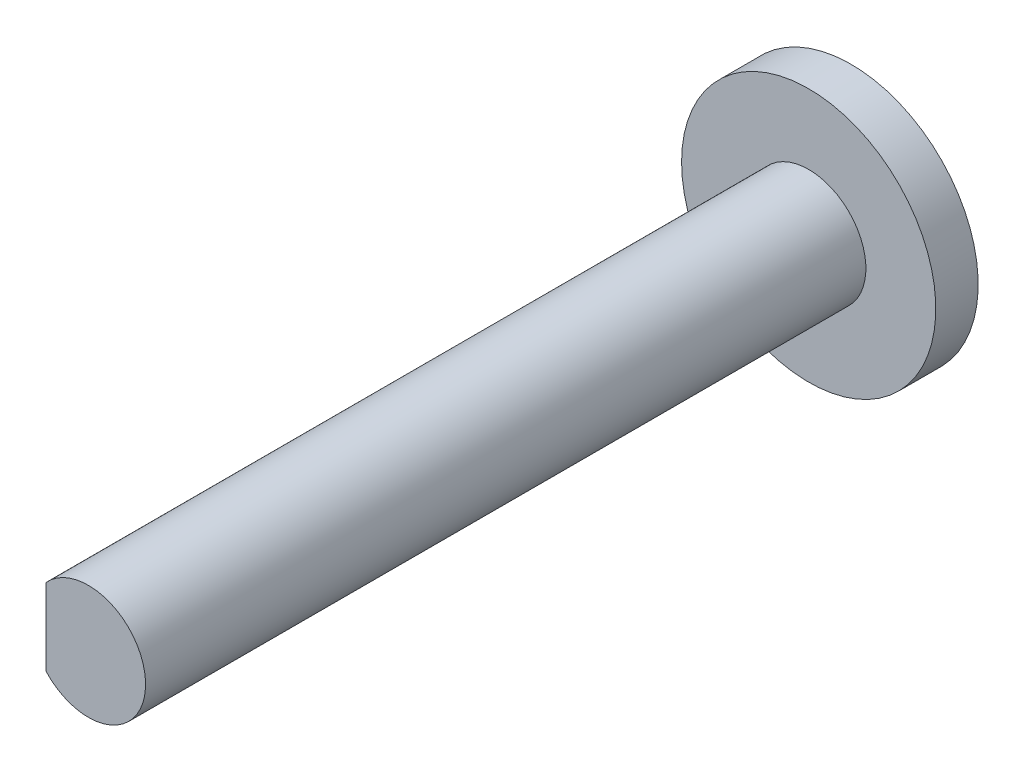
ISO-10303-21;
HEADER;
FILE_DESCRIPTION(('STEP AP214'),'2;1');
FILE_NAME('part.step','',(''),(''),'','','');
FILE_SCHEMA(('AUTOMOTIVE_DESIGN { 1 0 10303 214 1 1 1 1 }'));
ENDSEC;
DATA;
#1=APPLICATION_CONTEXT('core data for automotive mechanical design processes');
#2=APPLICATION_PROTOCOL_DEFINITION('international standard','automotive_design',2000,#1);
#3=PRODUCT_CONTEXT('',#1,'mechanical');
#4=PRODUCT('Part','Part','',(#3));
#5=PRODUCT_RELATED_PRODUCT_CATEGORY('part','',(#4));
#6=PRODUCT_DEFINITION_FORMATION('','',#4);
#7=PRODUCT_DEFINITION_CONTEXT('part definition',#1,'design');
#8=PRODUCT_DEFINITION('design','',#6,#7);
#9=PRODUCT_DEFINITION_SHAPE('','',#8);
#10=(LENGTH_UNIT() NAMED_UNIT(*) SI_UNIT(.MILLI.,.METRE.));
#11=(NAMED_UNIT(*) PLANE_ANGLE_UNIT() SI_UNIT($,.RADIAN.));
#12=(NAMED_UNIT(*) SI_UNIT($,.STERADIAN.) SOLID_ANGLE_UNIT());
#13=UNCERTAINTY_MEASURE_WITH_UNIT(LENGTH_MEASURE(1.E-05),#10,'distance_accuracy_value','');
#14=(GEOMETRIC_REPRESENTATION_CONTEXT(3) GLOBAL_UNCERTAINTY_ASSIGNED_CONTEXT((#13)) GLOBAL_UNIT_ASSIGNED_CONTEXT((#10,
#11,#12)) REPRESENTATION_CONTEXT('',''));
#15=CARTESIAN_POINT('',(0.,0.,0.));
#16=DIRECTION('',(0.,0.,1.));
#17=DIRECTION('',(1.,0.,0.));
#18=AXIS2_PLACEMENT_3D('',#15,#16,#17);
#19=CARTESIAN_POINT('',(0.,0.,8.5));
#20=DIRECTION('',(0.,0.,-1.));
#21=DIRECTION('',(-1.,0.,0.));
#22=AXIS2_PLACEMENT_3D('',#19,#20,#21);
#23=CYLINDRICAL_SURFACE('',#22,1.35);
#24=CARTESIAN_POINT('',(0.,0.,8.5));
#25=DIRECTION('',(0.,0.,1.));
#26=DIRECTION('',(1.,0.,0.));
#27=AXIS2_PLACEMENT_3D('',#24,#25,#26);
#28=CIRCLE('',#27,1.35);
#29=CARTESIAN_POINT('',(-1.,-0.906917857360853,8.5));
#30=VERTEX_POINT('',#29);
#31=CARTESIAN_POINT('',(-1.,0.906917857360853,8.5));
#32=VERTEX_POINT('',#31);
#33=EDGE_CURVE('E11',#30,#32,#28,.T.);
#34=ORIENTED_EDGE('',*,*,#33,.F.);
#35=DIRECTION('',(0.,0.,1.));
#36=VECTOR('',#35,1.);
#37=CARTESIAN_POINT('',(-1.,-0.906917857360853,5.3));
#38=LINE('',#37,#36);
#39=CARTESIAN_POINT('',(-1.,-0.906917857360853,5.3));
#40=VERTEX_POINT('',#39);
#41=EDGE_CURVE('E54',#40,#30,#38,.T.);
#42=ORIENTED_EDGE('',*,*,#41,.F.);
#43=CARTESIAN_POINT('',(0.,0.,5.3));
#44=DIRECTION('',(0.,0.,1.));
#45=DIRECTION('',(1.,0.,0.));
#46=AXIS2_PLACEMENT_3D('',#43,#44,#45);
#47=CIRCLE('',#46,1.35);
#48=CARTESIAN_POINT('',(-1.,0.906917857360853,5.3));
#49=VERTEX_POINT('',#48);
#50=EDGE_CURVE('E116',#49,#40,#47,.T.);
#51=ORIENTED_EDGE('',*,*,#50,.F.);
#52=DIRECTION('',(0.,0.,1.));
#53=VECTOR('',#52,1.);
#54=CARTESIAN_POINT('',(-1.,0.906917857360853,5.3));
#55=LINE('',#54,#53);
#56=EDGE_CURVE('E78',#49,#32,#55,.T.);
#57=ORIENTED_EDGE('',*,*,#56,.T.);
#58=EDGE_LOOP('',(#34,#42,#51,#57));
#59=FACE_BOUND('',#58,.T.);
#60=CARTESIAN_POINT('',(0.,0.,-2.1));
#61=DIRECTION('',(0.,0.,-1.));
#62=DIRECTION('',(-1.,0.,0.));
#63=AXIS2_PLACEMENT_3D('',#60,#61,#62);
#64=CIRCLE('',#63,1.35);
#65=CARTESIAN_POINT('',(-1.,-0.906917857360853,-2.1));
#66=VERTEX_POINT('',#65);
#67=CARTESIAN_POINT('',(-1.,0.906917857360853,-2.1));
#68=VERTEX_POINT('',#67);
#69=EDGE_CURVE('E91',#66,#68,#64,.T.);
#70=ORIENTED_EDGE('',*,*,#69,.F.);
#71=DIRECTION('',(0.,0.,-1.));
#72=VECTOR('',#71,1.);
#73=CARTESIAN_POINT('',(-1.,-0.906917857360853,-2.1));
#74=LINE('',#73,#72);
#75=CARTESIAN_POINT('',(-1.,-0.906917857360853,-8.5));
#76=VERTEX_POINT('',#75);
#77=EDGE_CURVE('E63',#66,#76,#74,.T.);
#78=ORIENTED_EDGE('',*,*,#77,.T.);
#79=CARTESIAN_POINT('',(0.,0.,-8.5));
#80=DIRECTION('',(0.,0.,1.));
#81=DIRECTION('',(1.,0.,0.));
#82=AXIS2_PLACEMENT_3D('',#79,#80,#81);
#83=CIRCLE('',#82,1.35);
#84=CARTESIAN_POINT('',(-1.,0.906917857360853,-8.5));
#85=VERTEX_POINT('',#84);
#86=EDGE_CURVE('E42',#76,#85,#83,.T.);
#87=ORIENTED_EDGE('',*,*,#86,.T.);
#88=DIRECTION('',(0.,0.,-1.));
#89=VECTOR('',#88,1.);
#90=CARTESIAN_POINT('',(-1.,0.906917857360853,-2.1));
#91=LINE('',#90,#89);
#92=EDGE_CURVE('E94',#68,#85,#91,.T.);
#93=ORIENTED_EDGE('',*,*,#92,.F.);
#94=EDGE_LOOP('',(#70,#78,#87,#93));
#95=FACE_BOUND('',#94,.T.);
#96=ADVANCED_FACE('F39',(#59,#95),#23,.T.);
#97=CARTESIAN_POINT('',(0.,0.,8.5));
#98=DIRECTION('',(0.,0.,1.));
#99=DIRECTION('',(1.,0.,0.));
#100=AXIS2_PLACEMENT_3D('',#97,#98,#99);
#101=PLANE('',#100);
#102=DIRECTION('',(0.,1.,0.));
#103=VECTOR('',#102,1.);
#104=CARTESIAN_POINT('',(-1.,0.906917857360853,8.5));
#105=LINE('',#104,#103);
#106=EDGE_CURVE('E85',#30,#32,#105,.T.);
#107=ORIENTED_EDGE('',*,*,#106,.F.);
#108=ORIENTED_EDGE('',*,*,#33,.T.);
#109=EDGE_LOOP('',(#107,#108));
#110=FACE_BOUND('',#109,.T.);
#111=ADVANCED_FACE('F145',(#110),#101,.T.);
#112=CARTESIAN_POINT('',(-1.,0.906917857360853,-2.1));
#113=DIRECTION('',(1.,0.,0.));
#114=DIRECTION('',(0.,0.,-1.));
#115=AXIS2_PLACEMENT_3D('',#112,#113,#114);
#116=PLANE('',#115);
#117=DIRECTION('',(0.,-1.,0.));
#118=VECTOR('',#117,1.);
#119=CARTESIAN_POINT('',(-1.,0.906917857360853,-8.5));
#120=LINE('',#119,#118);
#121=EDGE_CURVE('E86',#85,#76,#120,.T.);
#122=ORIENTED_EDGE('',*,*,#121,.T.);
#123=ORIENTED_EDGE('',*,*,#77,.F.);
#124=DIRECTION('',(0.,-1.,0.));
#125=VECTOR('',#124,1.);
#126=CARTESIAN_POINT('',(-1.,0.906917857360853,-2.1));
#127=LINE('',#126,#125);
#128=EDGE_CURVE('E96',#68,#66,#127,.T.);
#129=ORIENTED_EDGE('',*,*,#128,.F.);
#130=ORIENTED_EDGE('',*,*,#92,.T.);
#131=EDGE_LOOP('',(#122,#123,#129,#130));
#132=FACE_BOUND('',#131,.T.);
#133=ADVANCED_FACE('F95',(#132),#116,.F.);
#134=CARTESIAN_POINT('',(0.,0.,-2.1));
#135=DIRECTION('',(0.,0.,-1.));
#136=DIRECTION('',(-1.,0.,0.));
#137=AXIS2_PLACEMENT_3D('',#134,#135,#136);
#138=PLANE('',#137);
#139=ORIENTED_EDGE('',*,*,#69,.T.);
#140=ORIENTED_EDGE('',*,*,#128,.T.);
#141=EDGE_LOOP('',(#139,#140));
#142=FACE_BOUND('',#141,.T.);
#143=ADVANCED_FACE('F158',(#142),#138,.T.);
#144=CARTESIAN_POINT('',(-1.,0.906917857360853,5.3));
#145=DIRECTION('',(1.,0.,0.));
#146=DIRECTION('',(0.,0.,-1.));
#147=AXIS2_PLACEMENT_3D('',#144,#145,#146);
#148=PLANE('',#147);
#149=ORIENTED_EDGE('',*,*,#106,.T.);
#150=ORIENTED_EDGE('',*,*,#56,.F.);
#151=DIRECTION('',(0.,1.,0.));
#152=VECTOR('',#151,1.);
#153=CARTESIAN_POINT('',(-1.,0.906917857360853,5.3));
#154=LINE('',#153,#152);
#155=EDGE_CURVE('E111',#40,#49,#154,.T.);
#156=ORIENTED_EDGE('',*,*,#155,.F.);
#157=ORIENTED_EDGE('',*,*,#41,.T.);
#158=EDGE_LOOP('',(#149,#150,#156,#157));
#159=FACE_BOUND('',#158,.T.);
#160=ADVANCED_FACE('F156',(#159),#148,.F.);
#161=CARTESIAN_POINT('',(0.,0.,5.3));
#162=DIRECTION('',(0.,0.,1.));
#163=DIRECTION('',(1.,0.,0.));
#164=AXIS2_PLACEMENT_3D('',#161,#162,#163);
#165=PLANE('',#164);
#166=ORIENTED_EDGE('',*,*,#50,.T.);
#167=ORIENTED_EDGE('',*,*,#155,.T.);
#168=EDGE_LOOP('',(#166,#167));
#169=FACE_BOUND('',#168,.T.);
#170=ADVANCED_FACE('F135',(#169),#165,.T.);
#171=CARTESIAN_POINT('',(0.,0.,-9.5));
#172=DIRECTION('',(0.,0.,1.));
#173=DIRECTION('',(1.,0.,0.));
#174=AXIS2_PLACEMENT_3D('',#171,#172,#173);
#175=CYLINDRICAL_SURFACE('',#174,3.);
#176=CARTESIAN_POINT('',(0.,0.,-9.5));
#177=DIRECTION('',(0.,0.,-1.));
#178=DIRECTION('',(-1.,0.,0.));
#179=AXIS2_PLACEMENT_3D('',#176,#177,#178);
#180=CIRCLE('',#179,3.);
#181=CARTESIAN_POINT('',(-3.,0.,-9.5));
#182=VERTEX_POINT('',#181);
#183=EDGE_CURVE('E117',#182,#182,#180,.T.);
#184=ORIENTED_EDGE('',*,*,#183,.F.);
#185=EDGE_LOOP('',(#184));
#186=FACE_BOUND('',#185,.T.);
#187=CARTESIAN_POINT('',(0.,0.,-8.5));
#188=DIRECTION('',(0.,0.,-1.));
#189=DIRECTION('',(-1.,0.,0.));
#190=AXIS2_PLACEMENT_3D('',#187,#188,#189);
#191=CIRCLE('',#190,3.);
#192=CARTESIAN_POINT('',(-3.,0.,-8.5));
#193=VERTEX_POINT('',#192);
#194=EDGE_CURVE('E122',#193,#193,#191,.T.);
#195=ORIENTED_EDGE('',*,*,#194,.T.);
#196=EDGE_LOOP('',(#195));
#197=FACE_BOUND('',#196,.T.);
#198=ADVANCED_FACE('F132',(#186,#197),#175,.T.);
#199=CARTESIAN_POINT('',(0.,0.,-9.5));
#200=DIRECTION('',(0.,0.,-1.));
#201=DIRECTION('',(-1.,0.,0.));
#202=AXIS2_PLACEMENT_3D('',#199,#200,#201);
#203=PLANE('',#202);
#204=ORIENTED_EDGE('',*,*,#183,.T.);
#205=EDGE_LOOP('',(#204));
#206=FACE_BOUND('',#205,.T.);
#207=ADVANCED_FACE('F130',(#206),#203,.T.);
#208=CARTESIAN_POINT('',(0.,0.,-8.5));
#209=DIRECTION('',(0.,0.,-1.));
#210=DIRECTION('',(-1.,0.,0.));
#211=AXIS2_PLACEMENT_3D('',#208,#209,#210);
#212=PLANE('',#211);
#213=ORIENTED_EDGE('',*,*,#86,.F.);
#214=ORIENTED_EDGE('',*,*,#121,.F.);
#215=EDGE_LOOP('',(#213,#214));
#216=FACE_BOUND('',#215,.T.);
#217=ORIENTED_EDGE('',*,*,#194,.F.);
#218=EDGE_LOOP('',(#217));
#219=FACE_BOUND('',#218,.T.);
#220=ADVANCED_FACE('F88',(#216,#219),#212,.F.);
#221=CLOSED_SHELL('',(#96,#111,#133,#143,#160,#170,#198,#207,#220));
#222=MANIFOLD_SOLID_BREP('B2',#221);
#223=ADVANCED_BREP_SHAPE_REPRESENTATION('',(#18,#222),#14);
#224=SHAPE_DEFINITION_REPRESENTATION(#9,#223);
ENDSEC;
END-ISO-10303-21;
